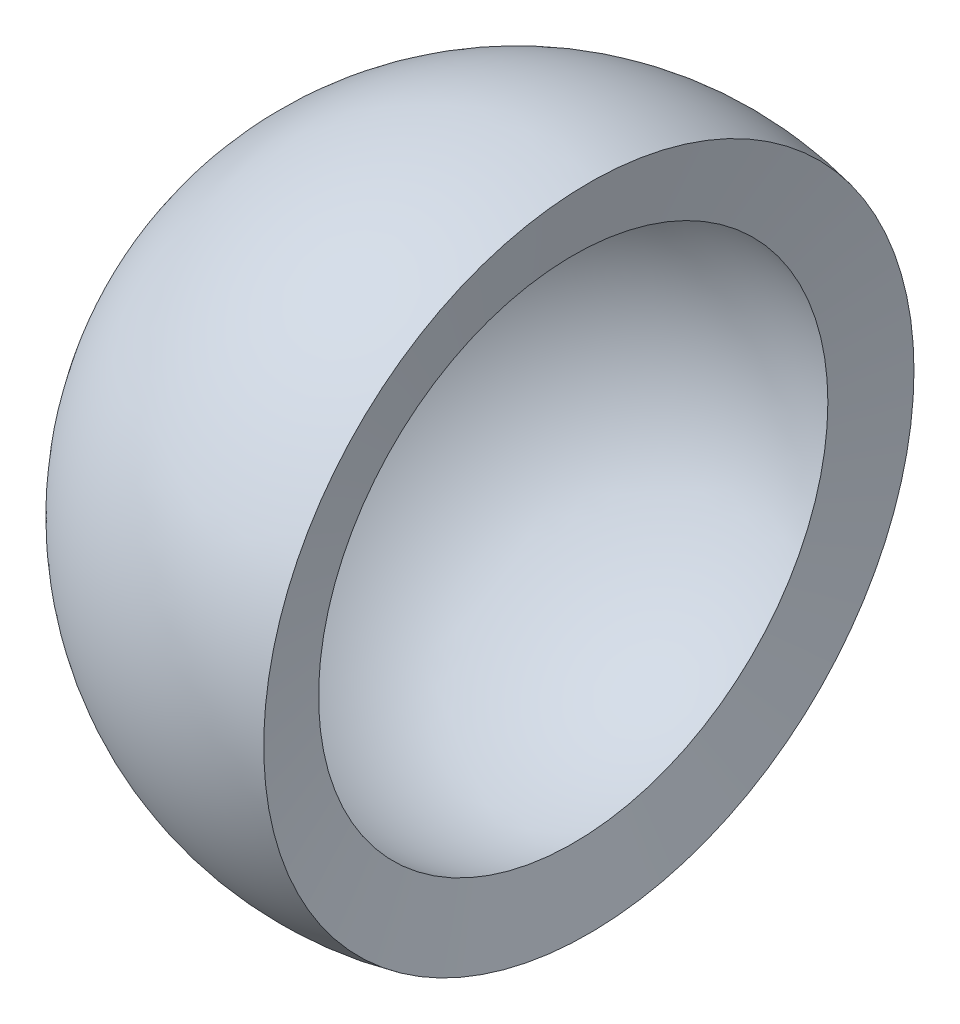
ISO-10303-21;
HEADER;
FILE_DESCRIPTION(('STEP AP214'),'2;1');
FILE_NAME('part.step','',(''),(''),'','','');
FILE_SCHEMA(('AUTOMOTIVE_DESIGN { 1 0 10303 214 1 1 1 1 }'));
ENDSEC;
DATA;
#1=APPLICATION_CONTEXT('core data for automotive mechanical design processes');
#2=APPLICATION_PROTOCOL_DEFINITION('international standard','automotive_design',2000,#1);
#3=PRODUCT_CONTEXT('',#1,'mechanical');
#4=PRODUCT('Part','Part','',(#3));
#5=PRODUCT_RELATED_PRODUCT_CATEGORY('part','',(#4));
#6=PRODUCT_DEFINITION_FORMATION('','',#4);
#7=PRODUCT_DEFINITION_CONTEXT('part definition',#1,'design');
#8=PRODUCT_DEFINITION('design','',#6,#7);
#9=PRODUCT_DEFINITION_SHAPE('','',#8);
#10=(LENGTH_UNIT() NAMED_UNIT(*) SI_UNIT(.MILLI.,.METRE.));
#11=(NAMED_UNIT(*) PLANE_ANGLE_UNIT() SI_UNIT($,.RADIAN.));
#12=(NAMED_UNIT(*) SI_UNIT($,.STERADIAN.) SOLID_ANGLE_UNIT());
#13=UNCERTAINTY_MEASURE_WITH_UNIT(LENGTH_MEASURE(1.E-05),#10,'distance_accuracy_value','');
#14=(GEOMETRIC_REPRESENTATION_CONTEXT(3) GLOBAL_UNCERTAINTY_ASSIGNED_CONTEXT((#13)) GLOBAL_UNIT_ASSIGNED_CONTEXT((#10,
#11,#12)) REPRESENTATION_CONTEXT('',''));
#15=CARTESIAN_POINT('',(0.,0.,0.));
#16=DIRECTION('',(0.,0.,1.));
#17=DIRECTION('',(1.,0.,0.));
#18=AXIS2_PLACEMENT_3D('',#15,#16,#17);
#19=CARTESIAN_POINT('',(0.,0.,0.));
#20=DIRECTION('',(1.,0.,0.));
#21=DIRECTION('',(0.,0.,-1.));
#22=AXIS2_PLACEMENT_3D('',#19,#20,#21);
#23=SPHERICAL_SURFACE('',#22,19.);
#24=CARTESIAN_POINT('',(4.11163157332061,0.,0.));
#25=DIRECTION('',(1.,0.,0.));
#26=DIRECTION('',(0.,0.,-1.));
#27=AXIS2_PLACEMENT_3D('',#24,#25,#26);
#28=CIRCLE('',#27,18.5497839827119);
#29=CARTESIAN_POINT('',(4.11163157332061,0.,-18.5497839827119));
#30=VERTEX_POINT('',#29);
#31=EDGE_CURVE('E10',#30,#30,#28,.T.);
#32=ORIENTED_EDGE('',*,*,#31,.T.);
#33=EDGE_LOOP('',(#32));
#34=FACE_BOUND('',#33,.T.);
#35=ADVANCED_FACE('F31',(#34),#23,.F.);
#36=CARTESIAN_POINT('',(4.11163157332061,0.,0.));
#37=DIRECTION('',(1.,0.,0.));
#38=DIRECTION('',(0.,0.,-1.));
#39=AXIS2_PLACEMENT_3D('',#36,#37,#38);
#40=CONICAL_SURFACE('',#39,18.5497839827119,1.3526690437731);
#41=CARTESIAN_POINT('',(5.24985322703182,0.,0.));
#42=DIRECTION('',(1.,0.,0.));
#43=DIRECTION('',(0.,0.,-1.));
#44=AXIS2_PLACEMENT_3D('',#41,#42,#43);
#45=CIRCLE('',#44,23.6849147511859);
#46=CARTESIAN_POINT('',(5.24985322703182,0.,-23.6849147511859));
#47=VERTEX_POINT('',#46);
#48=EDGE_CURVE('E37',#47,#47,#45,.T.);
#49=ORIENTED_EDGE('',*,*,#48,.T.);
#50=EDGE_LOOP('',(#49));
#51=FACE_BOUND('',#50,.T.);
#52=ORIENTED_EDGE('',*,*,#31,.F.);
#53=EDGE_LOOP('',(#52));
#54=FACE_BOUND('',#53,.T.);
#55=ADVANCED_FACE('F43',(#51,#54),#40,.F.);
#56=CARTESIAN_POINT('',(0.,0.,0.));
#57=DIRECTION('',(1.,0.,0.));
#58=DIRECTION('',(0.,0.,-1.));
#59=AXIS2_PLACEMENT_3D('',#56,#57,#58);
#60=SPHERICAL_SURFACE('',#59,24.2597639245793);
#61=ORIENTED_EDGE('',*,*,#48,.F.);
#62=EDGE_LOOP('',(#61));
#63=FACE_BOUND('',#62,.T.);
#64=ADVANCED_FACE('F46',(#63),#60,.T.);
#65=CLOSED_SHELL('',(#35,#55,#64));
#66=MANIFOLD_SOLID_BREP('B2',#65);
#67=ADVANCED_BREP_SHAPE_REPRESENTATION('',(#18,#66),#14);
#68=SHAPE_DEFINITION_REPRESENTATION(#9,#67);
ENDSEC;
END-ISO-10303-21;
